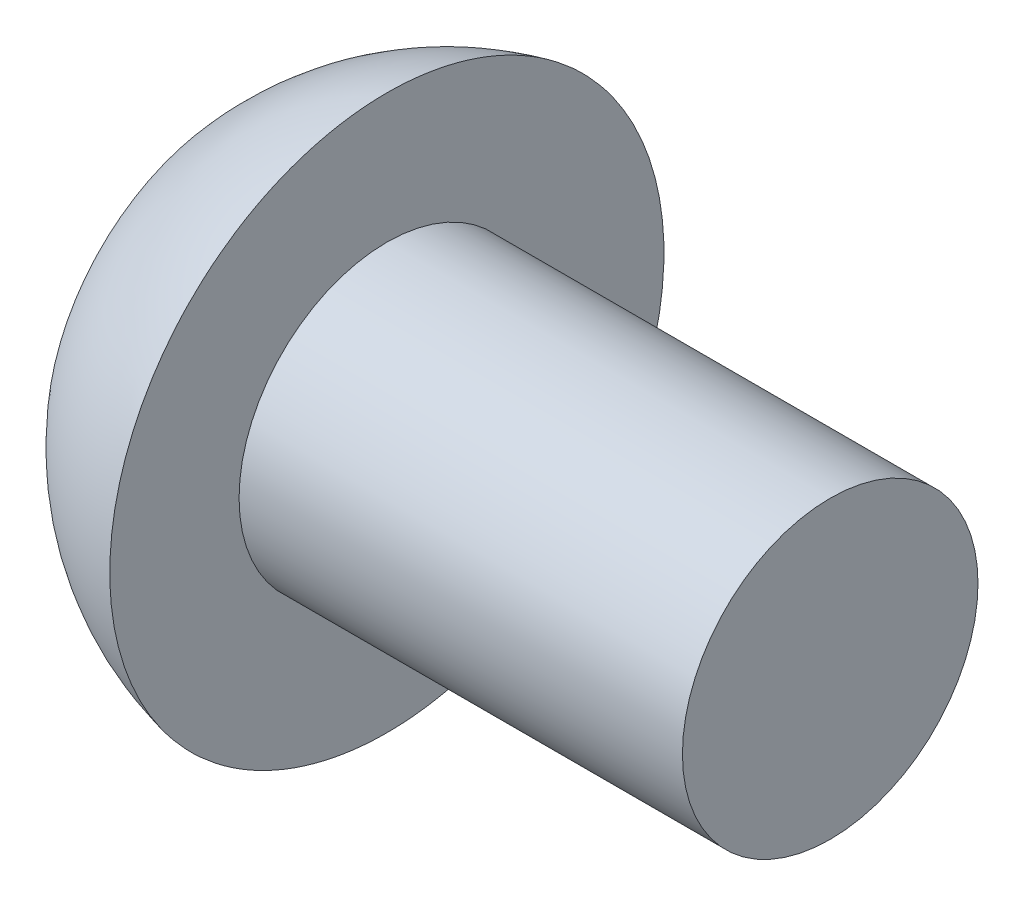
ISO-10303-21;
HEADER;
FILE_DESCRIPTION(('STEP AP214'),'2;1');
FILE_NAME('part.step','',(''),(''),'','','');
FILE_SCHEMA(('AUTOMOTIVE_DESIGN { 1 0 10303 214 1 1 1 1 }'));
ENDSEC;
DATA;
#1=APPLICATION_CONTEXT('core data for automotive mechanical design processes');
#2=APPLICATION_PROTOCOL_DEFINITION('international standard','automotive_design',2000,#1);
#3=PRODUCT_CONTEXT('',#1,'mechanical');
#4=PRODUCT('Part','Part','',(#3));
#5=PRODUCT_RELATED_PRODUCT_CATEGORY('part','',(#4));
#6=PRODUCT_DEFINITION_FORMATION('','',#4);
#7=PRODUCT_DEFINITION_CONTEXT('part definition',#1,'design');
#8=PRODUCT_DEFINITION('design','',#6,#7);
#9=PRODUCT_DEFINITION_SHAPE('','',#8);
#10=(LENGTH_UNIT() NAMED_UNIT(*) SI_UNIT(.MILLI.,.METRE.));
#11=(NAMED_UNIT(*) PLANE_ANGLE_UNIT() SI_UNIT($,.RADIAN.));
#12=(NAMED_UNIT(*) SI_UNIT($,.STERADIAN.) SOLID_ANGLE_UNIT());
#13=UNCERTAINTY_MEASURE_WITH_UNIT(LENGTH_MEASURE(1.E-05),#10,'distance_accuracy_value','');
#14=(GEOMETRIC_REPRESENTATION_CONTEXT(3) GLOBAL_UNCERTAINTY_ASSIGNED_CONTEXT((#13)) GLOBAL_UNIT_ASSIGNED_CONTEXT((#10,
#11,#12)) REPRESENTATION_CONTEXT('',''));
#15=CARTESIAN_POINT('',(0.,0.,0.));
#16=DIRECTION('',(0.,0.,1.));
#17=DIRECTION('',(1.,0.,0.));
#18=AXIS2_PLACEMENT_3D('',#15,#16,#17);
#19=CARTESIAN_POINT('',(1.3,0.,0.));
#20=DIRECTION('',(-1.,0.,0.));
#21=DIRECTION('',(0.,0.,1.));
#22=AXIS2_PLACEMENT_3D('',#19,#20,#21);
#23=PLANE('',#22);
#24=DIRECTION('',(0.,0.866025403784439,-0.5));
#25=VECTOR('',#24,1.);
#26=CARTESIAN_POINT('',(1.3,0.,-1.44337567297406));
#27=LINE('',#26,#25);
#28=CARTESIAN_POINT('',(1.3,0.,-1.44337567297406));
#29=VERTEX_POINT('',#28);
#30=CARTESIAN_POINT('',(1.3,-1.25,-0.721687836487033));
#31=VERTEX_POINT('',#30);
#32=EDGE_CURVE('E95',#29,#31,#27,.F.);
#33=ORIENTED_EDGE('',*,*,#32,.T.);
#34=DIRECTION('',(0.,0.,-1.));
#35=VECTOR('',#34,1.);
#36=CARTESIAN_POINT('',(1.3,-1.25,-0.721687836487033));
#37=LINE('',#36,#35);
#38=CARTESIAN_POINT('',(1.3,-1.25,0.721687836487032));
#39=VERTEX_POINT('',#38);
#40=EDGE_CURVE('E142',#31,#39,#37,.F.);
#41=ORIENTED_EDGE('',*,*,#40,.T.);
#42=DIRECTION('',(0.,-0.866025403784439,-0.5));
#43=VECTOR('',#42,1.);
#44=CARTESIAN_POINT('',(1.3,-1.25,0.721687836487032));
#45=LINE('',#44,#43);
#46=CARTESIAN_POINT('',(1.3,0.,1.44337567297406));
#47=VERTEX_POINT('',#46);
#48=EDGE_CURVE('E137',#39,#47,#45,.F.);
#49=ORIENTED_EDGE('',*,*,#48,.T.);
#50=DIRECTION('',(0.,-0.866025403784439,0.5));
#51=VECTOR('',#50,1.);
#52=CARTESIAN_POINT('',(1.3,0.,1.44337567297406));
#53=LINE('',#52,#51);
#54=CARTESIAN_POINT('',(1.3,1.25,0.721687836487031));
#55=VERTEX_POINT('',#54);
#56=EDGE_CURVE('E78',#47,#55,#53,.F.);
#57=ORIENTED_EDGE('',*,*,#56,.T.);
#58=DIRECTION('',(0.,0.,1.));
#59=VECTOR('',#58,1.);
#60=CARTESIAN_POINT('',(1.3,1.25,0.721687836487031));
#61=LINE('',#60,#59);
#62=CARTESIAN_POINT('',(1.3,1.25,-0.721687836487033));
#63=VERTEX_POINT('',#62);
#64=EDGE_CURVE('E75',#55,#63,#61,.F.);
#65=ORIENTED_EDGE('',*,*,#64,.T.);
#66=DIRECTION('',(0.,0.866025403784439,0.5));
#67=VECTOR('',#66,1.);
#68=CARTESIAN_POINT('',(1.3,1.25,-0.721687836487033));
#69=LINE('',#68,#67);
#70=EDGE_CURVE('E72',#63,#29,#69,.F.);
#71=ORIENTED_EDGE('',*,*,#70,.T.);
#72=EDGE_LOOP('',(#33,#41,#49,#57,#65,#71));
#73=FACE_BOUND('',#72,.T.);
#74=ADVANCED_FACE('F17',(#73),#23,.T.);
#75=CARTESIAN_POINT('',(1.3,1.25,0.721687836487031));
#76=DIRECTION('',(0.,1.,0.));
#77=DIRECTION('',(0.,0.,1.));
#78=AXIS2_PLACEMENT_3D('',#75,#76,#77);
#79=PLANE('',#78);
#80=DIRECTION('',(1.,0.,0.));
#81=VECTOR('',#80,1.);
#82=CARTESIAN_POINT('',(1.3,1.25,-0.721687836487033));
#83=LINE('',#82,#81);
#84=CARTESIAN_POINT('',(0.,1.25,-0.721687836487033));
#85=VERTEX_POINT('',#84);
#86=EDGE_CURVE('E81',#85,#63,#83,.T.);
#87=ORIENTED_EDGE('',*,*,#86,.T.);
#88=ORIENTED_EDGE('',*,*,#64,.F.);
#89=DIRECTION('',(1.,0.,0.));
#90=VECTOR('',#89,1.);
#91=CARTESIAN_POINT('',(1.3,1.25,0.721687836487031));
#92=LINE('',#91,#90);
#93=CARTESIAN_POINT('',(0.,1.25,0.721687836487031));
#94=VERTEX_POINT('',#93);
#95=EDGE_CURVE('E132',#55,#94,#92,.F.);
#96=ORIENTED_EDGE('',*,*,#95,.T.);
#97=DIRECTION('',(0.,0.,-1.));
#98=VECTOR('',#97,1.);
#99=CARTESIAN_POINT('',(0.,1.25,0.));
#100=LINE('',#99,#98);
#101=EDGE_CURVE('E86',#94,#85,#100,.T.);
#102=ORIENTED_EDGE('',*,*,#101,.T.);
#103=EDGE_LOOP('',(#87,#88,#96,#102));
#104=FACE_BOUND('',#103,.T.);
#105=ADVANCED_FACE('F84',(#104),#79,.F.);
#106=CARTESIAN_POINT('',(1.3,1.25,-0.721687836487033));
#107=DIRECTION('',(0.,0.5,-0.866025403784439));
#108=DIRECTION('',(0.,0.866025403784439,0.5));
#109=AXIS2_PLACEMENT_3D('',#106,#107,#108);
#110=PLANE('',#109);
#111=DIRECTION('',(1.,0.,0.));
#112=VECTOR('',#111,1.);
#113=CARTESIAN_POINT('',(1.3,0.,-1.44337567297406));
#114=LINE('',#113,#112);
#115=CARTESIAN_POINT('',(0.,0.,-1.44337567297406));
#116=VERTEX_POINT('',#115);
#117=EDGE_CURVE('E92',#116,#29,#114,.T.);
#118=ORIENTED_EDGE('',*,*,#117,.T.);
#119=ORIENTED_EDGE('',*,*,#70,.F.);
#120=ORIENTED_EDGE('',*,*,#86,.F.);
#121=DIRECTION('',(0.,-0.866025403784439,-0.5));
#122=VECTOR('',#121,1.);
#123=CARTESIAN_POINT('',(0.,1.25,-0.721687836487033));
#124=LINE('',#123,#122);
#125=EDGE_CURVE('E129',#85,#116,#124,.T.);
#126=ORIENTED_EDGE('',*,*,#125,.T.);
#127=EDGE_LOOP('',(#118,#119,#120,#126));
#128=FACE_BOUND('',#127,.T.);
#129=ADVANCED_FACE('F90',(#128),#110,.F.);
#130=CARTESIAN_POINT('',(1.3,0.,-1.44337567297406));
#131=DIRECTION('',(0.,-0.5,-0.866025403784439));
#132=DIRECTION('',(0.,0.866025403784439,-0.5));
#133=AXIS2_PLACEMENT_3D('',#130,#131,#132);
#134=PLANE('',#133);
#135=DIRECTION('',(1.,0.,0.));
#136=VECTOR('',#135,1.);
#137=CARTESIAN_POINT('',(1.3,-1.25,-0.721687836487033));
#138=LINE('',#137,#136);
#139=CARTESIAN_POINT('',(0.,-1.25,-0.721687836487033));
#140=VERTEX_POINT('',#139);
#141=EDGE_CURVE('E144',#140,#31,#138,.T.);
#142=ORIENTED_EDGE('',*,*,#141,.T.);
#143=ORIENTED_EDGE('',*,*,#32,.F.);
#144=ORIENTED_EDGE('',*,*,#117,.F.);
#145=DIRECTION('',(0.,-0.866025403784439,0.5));
#146=VECTOR('',#145,1.);
#147=CARTESIAN_POINT('',(0.,0.,-1.44337567297406));
#148=LINE('',#147,#146);
#149=EDGE_CURVE('E127',#116,#140,#148,.T.);
#150=ORIENTED_EDGE('',*,*,#149,.T.);
#151=EDGE_LOOP('',(#142,#143,#144,#150));
#152=FACE_BOUND('',#151,.T.);
#153=ADVANCED_FACE('F149',(#152),#134,.F.);
#154=CARTESIAN_POINT('',(1.3,-1.25,-0.721687836487033));
#155=DIRECTION('',(0.,-1.,0.));
#156=DIRECTION('',(0.,0.,-1.));
#157=AXIS2_PLACEMENT_3D('',#154,#155,#156);
#158=PLANE('',#157);
#159=DIRECTION('',(1.,0.,0.));
#160=VECTOR('',#159,1.);
#161=CARTESIAN_POINT('',(1.3,-1.25,0.721687836487032));
#162=LINE('',#161,#160);
#163=CARTESIAN_POINT('',(0.,-1.25,0.721687836487032));
#164=VERTEX_POINT('',#163);
#165=EDGE_CURVE('E139',#164,#39,#162,.T.);
#166=ORIENTED_EDGE('',*,*,#165,.T.);
#167=ORIENTED_EDGE('',*,*,#40,.F.);
#168=ORIENTED_EDGE('',*,*,#141,.F.);
#169=DIRECTION('',(0.,0.,-1.));
#170=VECTOR('',#169,1.);
#171=CARTESIAN_POINT('',(0.,-1.25,0.));
#172=LINE('',#171,#170);
#173=EDGE_CURVE('E125',#140,#164,#172,.F.);
#174=ORIENTED_EDGE('',*,*,#173,.T.);
#175=EDGE_LOOP('',(#166,#167,#168,#174));
#176=FACE_BOUND('',#175,.T.);
#177=ADVANCED_FACE('F153',(#176),#158,.F.);
#178=CARTESIAN_POINT('',(1.3,-1.25,0.721687836487032));
#179=DIRECTION('',(0.,-0.5,0.866025403784439));
#180=DIRECTION('',(0.,-0.866025403784439,-0.5));
#181=AXIS2_PLACEMENT_3D('',#178,#179,#180);
#182=PLANE('',#181);
#183=DIRECTION('',(1.,0.,0.));
#184=VECTOR('',#183,1.);
#185=CARTESIAN_POINT('',(1.3,0.,1.44337567297406));
#186=LINE('',#185,#184);
#187=CARTESIAN_POINT('',(0.,0.,1.44337567297406));
#188=VERTEX_POINT('',#187);
#189=EDGE_CURVE('E135',#188,#47,#186,.T.);
#190=ORIENTED_EDGE('',*,*,#189,.T.);
#191=ORIENTED_EDGE('',*,*,#48,.F.);
#192=ORIENTED_EDGE('',*,*,#165,.F.);
#193=DIRECTION('',(0.,0.866025403784439,0.5));
#194=VECTOR('',#193,1.);
#195=CARTESIAN_POINT('',(0.,-1.25,0.721687836487032));
#196=LINE('',#195,#194);
#197=EDGE_CURVE('E39',#164,#188,#196,.T.);
#198=ORIENTED_EDGE('',*,*,#197,.T.);
#199=EDGE_LOOP('',(#190,#191,#192,#198));
#200=FACE_BOUND('',#199,.T.);
#201=ADVANCED_FACE('F155',(#200),#182,.F.);
#202=CARTESIAN_POINT('',(1.3,0.,1.44337567297406));
#203=DIRECTION('',(0.,0.5,0.866025403784439));
#204=DIRECTION('',(0.,-0.866025403784439,0.5));
#205=AXIS2_PLACEMENT_3D('',#202,#203,#204);
#206=PLANE('',#205);
#207=ORIENTED_EDGE('',*,*,#95,.F.);
#208=ORIENTED_EDGE('',*,*,#56,.F.);
#209=ORIENTED_EDGE('',*,*,#189,.F.);
#210=DIRECTION('',(0.,0.866025403784439,-0.5));
#211=VECTOR('',#210,1.);
#212=CARTESIAN_POINT('',(0.,0.,1.44337567297406));
#213=LINE('',#212,#211);
#214=EDGE_CURVE('E121',#188,#94,#213,.T.);
#215=ORIENTED_EDGE('',*,*,#214,.T.);
#216=EDGE_LOOP('',(#207,#208,#209,#215));
#217=FACE_BOUND('',#216,.T.);
#218=ADVANCED_FACE('F158',(#217),#206,.F.);
#219=CARTESIAN_POINT('',(0.,0.,0.));
#220=DIRECTION('',(1.,0.,0.));
#221=DIRECTION('',(0.,0.,-1.));
#222=AXIS2_PLACEMENT_3D('',#219,#220,#221);
#223=PLANE('',#222);
#224=CARTESIAN_POINT('',(0.,-2.5,0.));
#225=CARTESIAN_POINT('',(0.,-2.49999957936132,-0.0701921599960447));
#226=CARTESIAN_POINT('',(0.,-2.49704119342716,-0.140397219697565));
#227=CARTESIAN_POINT('',(0.,-2.48522688336905,-0.280322179188911));
#228=CARTESIAN_POINT('',(0.,-2.47636921810709,-0.350041929602119));
#229=CARTESIAN_POINT('',(0.,-2.45279620034309,-0.488604766514831));
#230=CARTESIAN_POINT('',(0.,-2.43807154943064,-0.557446281525975));
#231=CARTESIAN_POINT('',(0.,-2.40286605989034,-0.693682439581397));
#232=CARTESIAN_POINT('',(0.,-2.38238055007889,-0.761075860507865));
#233=CARTESIAN_POINT('',(0.,-2.31256595562957,-0.960073508547833));
#234=CARTESIAN_POINT('',(0.,-2.25482146137571,-1.08883001715421));
#235=CARTESIAN_POINT('',(0.,-2.11850508057902,-1.33480670428014));
#236=CARTESIAN_POINT('',(0.,-2.03993240229859,-1.45202644402247));
#237=CARTESIAN_POINT('',(0.,-1.90824104297611,-1.61665670241218));
#238=CARTESIAN_POINT('',(0.,-1.8620037639557,-1.66969790909812));
#239=CARTESIAN_POINT('',(0.,-1.76526174331412,-1.77166010119879));
#240=CARTESIAN_POINT('',(0.,-1.71476115915119,-1.82058500982101));
#241=CARTESIAN_POINT('',(0.,-1.60979378920237,-1.91402800842039));
#242=CARTESIAN_POINT('',(0.,-1.55532521712319,-1.95854409210621));
#243=CARTESIAN_POINT('',(0.,-1.44283652737546,-2.04283394018785));
#244=CARTESIAN_POINT('',(0.,-1.38481559005068,-2.08260660382087));
#245=CARTESIAN_POINT('',(0.,-1.20605688653428,-2.19433902055891));
#246=CARTESIAN_POINT('',(0.,-1.08051229851521,-2.25881176834579));
#247=CARTESIAN_POINT('',(0.,-0.820448664949676,-2.36572576688644));
#248=CARTESIAN_POINT('',(1.93521310923399E-13,-0.685929715270905,-2.40816725294437));
#249=CARTESIAN_POINT('',(1.8117892693104E-13,-0.411658452824049,-2.46987540914283));
#250=CARTESIAN_POINT('',(0.,-0.271906112111544,-2.48914195551932));
#251=CARTESIAN_POINT('',(0.,0.00884938351142635,-2.50393336511607));
#252=CARTESIAN_POINT('',(0.,0.149852538421891,-2.49945822833632));
#253=CARTESIAN_POINT('',(0.,0.429089566312493,-2.46691127455503));
#254=CARTESIAN_POINT('',(0.,0.567323454077604,-2.43883958356868));
#255=CARTESIAN_POINT('',(0.,0.837181597907466,-2.35984414828296));
#256=CARTESIAN_POINT('',(0.,0.968805783360285,-2.30892015990856));
#257=CARTESIAN_POINT('',(0.,1.15831539846374,-2.21658970547271));
#258=CARTESIAN_POINT('',(0.,1.22019432802738,-2.1831338836091));
#259=CARTESIAN_POINT('',(0.,1.34091721220196,-2.11113062640944));
#260=CARTESIAN_POINT('',(0.,1.39976186626677,-2.07258437186948));
#261=CARTESIAN_POINT('',(0.,1.51396685324675,-1.99068831769029));
#262=CARTESIAN_POINT('',(0.,1.56932875175144,-1.94734070093405));
#263=CARTESIAN_POINT('',(0.,1.67624909519159,-1.85610831998061));
#264=CARTESIAN_POINT('',(0.,1.72780381792284,-1.80821921744136));
#265=CARTESIAN_POINT('',(1.28795875149044E-13,1.8760649939344,-1.65833806523957));
#266=CARTESIAN_POINT('',(0.,1.96651979560597,-1.55002342166828));
#267=CARTESIAN_POINT('',(0.,2.12792802522677,-1.31973215024525));
#268=CARTESIAN_POINT('',(0.,2.19888219442522,-1.19775604193507));
#269=CARTESIAN_POINT('',(0.,2.28922037059513,-1.00719593212754));
#270=CARTESIAN_POINT('',(0.,2.31667397063703,-0.942328150131031));
#271=CARTESIAN_POINT('',(0.,2.3659998478264,-0.810545468814501));
#272=CARTESIAN_POINT('',(0.,2.3878766418818,-0.743632275680556));
#273=CARTESIAN_POINT('',(0.,2.4258789239337,-0.608313490958524));
#274=CARTESIAN_POINT('',(0.,2.44201349373827,-0.539910439207929));
#275=CARTESIAN_POINT('',(0.,2.46846529090744,-0.402001503176486));
#276=CARTESIAN_POINT('',(0.,2.47878423407526,-0.332495950398821));
#277=CARTESIAN_POINT('',(0.,2.49076983986676,-0.21906889148678));
#278=CARTESIAN_POINT('',(0.,2.49423005456515,-0.175328990096958));
#279=CARTESIAN_POINT('',(0.,2.49884526607024,-0.0877277385030351));
#280=CARTESIAN_POINT('',(0.,2.50000026287693,-0.0438663882989335));
#281=CARTESIAN_POINT('',(0.,2.49999957936132,0.070192159996044));
#282=CARTESIAN_POINT('',(0.,2.49704119342716,0.140397219697564));
#283=CARTESIAN_POINT('',(0.,2.48522688336906,0.280322179188911));
#284=CARTESIAN_POINT('',(0.,2.47636921810709,0.350041929602119));
#285=CARTESIAN_POINT('',(0.,2.45279620034309,0.488604766514831));
#286=CARTESIAN_POINT('',(0.,2.43807154943064,0.557446281525974));
#287=CARTESIAN_POINT('',(0.,2.40286605989033,0.693682439581397));
#288=CARTESIAN_POINT('',(0.,2.38238055007889,0.761075860507866));
#289=CARTESIAN_POINT('',(0.,2.31256595562957,0.960073508547833));
#290=CARTESIAN_POINT('',(0.,2.25482146137571,1.08883001715421));
#291=CARTESIAN_POINT('',(0.,2.11850508057902,1.33480670428014));
#292=CARTESIAN_POINT('',(0.,2.03993240229859,1.45202644402247));
#293=CARTESIAN_POINT('',(0.,1.90824104297611,1.61665670241218));
#294=CARTESIAN_POINT('',(0.,1.8620037639557,1.66969790909812));
#295=CARTESIAN_POINT('',(0.,1.76526174331412,1.77166010119879));
#296=CARTESIAN_POINT('',(0.,1.71476115915119,1.82058500982101));
#297=CARTESIAN_POINT('',(0.,1.60979378920237,1.91402800842039));
#298=CARTESIAN_POINT('',(0.,1.55532521712319,1.95854409210621));
#299=CARTESIAN_POINT('',(0.,1.44283652737546,2.04283394018785));
#300=CARTESIAN_POINT('',(0.,1.38481559005068,2.08260660382087));
#301=CARTESIAN_POINT('',(0.,1.20605688653428,2.19433902055891));
#302=CARTESIAN_POINT('',(0.,1.08051229851521,2.25881176834579));
#303=CARTESIAN_POINT('',(0.,0.820448664949675,2.36572576688643));
#304=CARTESIAN_POINT('',(1.93183748400447E-13,0.685929715270904,2.40816725294437));
#305=CARTESIAN_POINT('',(1.81516491256711E-13,0.411658452824049,2.46987540914282));
#306=CARTESIAN_POINT('',(0.,0.271906112111543,2.48914195551932));
#307=CARTESIAN_POINT('',(0.,-0.0088493835114267,2.50393336511607));
#308=CARTESIAN_POINT('',(0.,-0.149852538421892,2.49945822833632));
#309=CARTESIAN_POINT('',(0.,-0.429089566312493,2.46691127455503));
#310=CARTESIAN_POINT('',(0.,-0.567323454077604,2.43883958356868));
#311=CARTESIAN_POINT('',(0.,-0.837181597907466,2.35984414828296));
#312=CARTESIAN_POINT('',(0.,-0.968805783360285,2.30892015990856));
#313=CARTESIAN_POINT('',(0.,-1.15831539846374,2.21658970547271));
#314=CARTESIAN_POINT('',(0.,-1.22019432802738,2.1831338836091));
#315=CARTESIAN_POINT('',(0.,-1.34091721220196,2.11113062640944));
#316=CARTESIAN_POINT('',(0.,-1.39976186626677,2.07258437186948));
#317=CARTESIAN_POINT('',(0.,-1.51396685324675,1.99068831769029));
#318=CARTESIAN_POINT('',(0.,-1.56932875175144,1.94734070093405));
#319=CARTESIAN_POINT('',(0.,-1.67624909519159,1.85610831998061));
#320=CARTESIAN_POINT('',(0.,-1.72780381792284,1.80821921744136));
#321=CARTESIAN_POINT('',(1.26351396747164E-13,-1.8760649939344,1.65833806523957));
#322=CARTESIAN_POINT('',(0.,-1.96651979560597,1.55002342166828));
#323=CARTESIAN_POINT('',(0.,-2.12792802522677,1.31973215024525));
#324=CARTESIAN_POINT('',(0.,-2.19888219442522,1.19775604193507));
#325=CARTESIAN_POINT('',(0.,-2.28922037059513,1.00719593212754));
#326=CARTESIAN_POINT('',(0.,-2.31667397063703,0.942328150131031));
#327=CARTESIAN_POINT('',(0.,-2.3659998478264,0.810545468814502));
#328=CARTESIAN_POINT('',(0.,-2.3878766418818,0.743632275680556));
#329=CARTESIAN_POINT('',(0.,-2.4258789239337,0.608313490958524));
#330=CARTESIAN_POINT('',(0.,-2.44201349373827,0.539910439207929));
#331=CARTESIAN_POINT('',(0.,-2.46846529090744,0.402001503176486));
#332=CARTESIAN_POINT('',(0.,-2.47878423407526,0.33249595039882));
#333=CARTESIAN_POINT('',(0.,-2.49076983986676,0.219068891486779));
#334=CARTESIAN_POINT('',(0.,-2.49423005456516,0.175328990096958));
#335=CARTESIAN_POINT('',(0.,-2.49884526607024,0.0877277385030345));
#336=CARTESIAN_POINT('',(0.,-2.50000026287693,0.0438663882989328));
#337=CARTESIAN_POINT('',(0.,-2.5,0.));
#338=B_SPLINE_CURVE_WITH_KNOTS('',3,(#224,#225,#226,#227,#228,#229,#230,#231,#232,#233,#234,
#235,#236,#237,#238,#239,#240,#241,#242,#243,#244,#245,#246,#247,#248,#249,#250,#251,#252,#253,
#254,#255,#256,#257,#258,#259,#260,#261,#262,#263,#264,#265,#266,#267,#268,#269,#270,#271,#272,
#273,#274,#275,#276,#277,#278,#279,#280,#281,#282,#283,#284,#285,#286,#287,#288,#289,#290,#291,
#292,#293,#294,#295,#296,#297,#298,#299,#300,#301,#302,#303,#304,#305,#306,#307,#308,#309,#310,
#311,#312,#313,#314,#315,#316,#317,#318,#319,#320,#321,#322,#323,#324,#325,#326,#327,#328,#329,
#330,#331,#332,#333,#334,#335,#336,#337),.UNSPECIFIED.,.T.,.F.,(4,2,2,2,2,2,2,2,2,2,2,2,2,2,2,2,
2,2,2,2,2,2,2,2,2,2,2,2,2,2,2,2,2,2,2,2,2,2,2,2,2,2,2,2,2,2,2,2,2,2,2,2,2,2,2,2,4),(0.,
0.210536096820072,0.421134359699302,0.632067729618591,0.843172630152281,1.2643761190993,
1.68559562146689,1.89648135010456,2.10716375313716,2.31794159353161,2.52876825245848,
2.94998199754238,3.37119124377402,3.7924027394319,4.2136142350898,4.63482348132149,
5.05603722640544,5.26686388533231,5.47764172572676,5.68832412875937,5.89920985739704,
6.32042935976463,6.74163284871166,6.95273774924535,7.16367111916464,7.37426938204387,
7.58480547886394,7.71637940641613,7.84795333396831,8.05848943078838,8.26908769366761,
8.4800210635869,8.69112596412059,9.11232945306761,9.53354895543521,9.74443468407287,
9.95511708710547,10.1658949274999,10.3767215864268,10.7979353315107,11.2191445777423,
11.6403560734002,12.0615675690581,12.4827768152898,12.9039905603737,13.1148172193006,
13.3255950596951,13.5362774627277,13.7471631913654,14.1683826937329,14.58958618268,
14.8006910832137,15.0116244531329,15.2222227160122,15.4327588128323,15.5643327403844,
15.6959066679366),.UNSPECIFIED.);
#339=CARTESIAN_POINT('',(0.,-2.5,0.));
#340=VERTEX_POINT('',#339);
#341=EDGE_CURVE('E20',#340,#340,#338,.T.);
#342=ORIENTED_EDGE('',*,*,#341,.F.);
#343=EDGE_LOOP('',(#342));
#344=FACE_BOUND('',#343,.T.);
#345=ORIENTED_EDGE('',*,*,#197,.F.);
#346=ORIENTED_EDGE('',*,*,#173,.F.);
#347=ORIENTED_EDGE('',*,*,#149,.F.);
#348=ORIENTED_EDGE('',*,*,#125,.F.);
#349=ORIENTED_EDGE('',*,*,#101,.F.);
#350=ORIENTED_EDGE('',*,*,#214,.F.);
#351=EDGE_LOOP('',(#345,#346,#347,#348,#349,#350));
#352=FACE_BOUND('',#351,.T.);
#353=ADVANCED_FACE('F114',(#344,#352),#223,.F.);
#354=CARTESIAN_POINT('',(2.91011904761905,0.,0.));
#355=DIRECTION('',(0.,1.,0.));
#356=DIRECTION('',(1.,0.,0.));
#357=AXIS2_PLACEMENT_3D('',#354,#355,#356);
#358=SPHERICAL_SURFACE('',#357,3.83650790059335);
#359=ORIENTED_EDGE('',*,*,#341,.T.);
#360=EDGE_LOOP('',(#359));
#361=FACE_BOUND('',#360,.T.);
#362=CARTESIAN_POINT('',(2.1,3.75,0.));
#363=CARTESIAN_POINT('',(2.1,3.74999970807574,-0.128760923490167));
#364=CARTESIAN_POINT('',(2.1,3.74335977074872,-0.257513251563214));
#365=CARTESIAN_POINT('',(2.1,3.716882281265,-0.51371210902152));
#366=CARTESIAN_POINT('',(2.1,3.69703612887407,-0.641157732492684));
#367=CARTESIAN_POINT('',(2.1,3.62754876330157,-0.973487008399234));
#368=CARTESIAN_POINT('',(2.1,3.56699233056529,-1.17619451338168));
#369=CARTESIAN_POINT('',(2.1,3.4126598106451,-1.56870187284758));
#370=CARTESIAN_POINT('',(2.1,3.31884766941476,-1.75848745081441));
#371=CARTESIAN_POINT('',(2.1,3.10071840543423,-2.11954960907214));
#372=CARTESIAN_POINT('',(2.1,2.9764142984283,-2.29083404191258));
#373=CARTESIAN_POINT('',(2.1,2.70084505467837,-2.61005630953823));
#374=CARTESIAN_POINT('',(2.1,2.54958623794051,-2.75799960176747));
#375=CARTESIAN_POINT('',(2.1,2.22436407466361,-3.02641034330814));
#376=CARTESIAN_POINT('',(2.1,2.05039852450514,-3.14687512279185));
#377=CARTESIAN_POINT('',(2.1,1.68470537542659,-3.35689292819582));
#378=CARTESIAN_POINT('',(2.1,1.49297706679099,-3.44644471830357));
#379=CARTESIAN_POINT('',(2.1,1.09721074586232,-3.5920868824784));
#380=CARTESIAN_POINT('',(2.1,0.893172961208296,-3.64817787512701));
#381=CARTESIAN_POINT('',(2.1,0.478577157929979,-3.725308519612));
#382=CARTESIAN_POINT('',(2.1,0.268019158844183,-3.74634827647265));
#383=CARTESIAN_POINT('',(2.1,-0.153640712009164,-3.75277951087031));
#384=CARTESIAN_POINT('',(2.1,-0.364742584143868,-3.73817096433584));
#385=CARTESIAN_POINT('',(2.1,-0.781497786795863,-3.67372036075235));
#386=CARTESIAN_POINT('',(2.1,-0.987151108345241,-3.62387824571522));
#387=CARTESIAN_POINT('',(2.1,-1.38717375779039,-3.49037374799647));
#388=CARTESIAN_POINT('',(2.1,-1.58154294054961,-3.40671093042329));
#389=CARTESIAN_POINT('',(2.1,-1.95347077346291,-3.20794537549092));
#390=CARTESIAN_POINT('',(2.1,-2.13102988347079,-3.09284349850873));
#391=CARTESIAN_POINT('',(2.1,-2.46429538879519,-2.834464966857));
#392=CARTESIAN_POINT('',(2.1,-2.62000323603539,-2.69119018567784));
#393=CARTESIAN_POINT('',(2.1,-2.90517199434076,-2.38053917273111));
#394=CARTESIAN_POINT('',(2.10000000000001,-3.03462869324269,-2.21315908047067));
#395=CARTESIAN_POINT('',(2.10000000000001,-3.26366553138365,-1.8588784717437));
#396=CARTESIAN_POINT('',(2.1,-3.36323701442936,-1.67197232068498));
#397=CARTESIAN_POINT('',(2.1,-3.48790054566113,-1.38137663397895));
#398=CARTESIAN_POINT('',(2.1,-3.52533839030707,-1.28280966784368));
#399=CARTESIAN_POINT('',(2.1,-3.59181195816412,-1.08281306376821));
#400=CARTESIAN_POINT('',(2.1,-3.62084375060508,-0.981382110845903));
#401=CARTESIAN_POINT('',(2.1,-3.68020647852303,-0.735144085500722));
#402=CARTESIAN_POINT('',(2.1,-3.70635667301652,-0.589311118238873));
#403=CARTESIAN_POINT('',(2.1,-3.74125017354579,-0.295647784790676));
#404=CARTESIAN_POINT('',(2.1,-3.7500003351306,-0.147818228375296));
#405=CARTESIAN_POINT('',(2.1,-3.74999970807574,0.128760923490166));
#406=CARTESIAN_POINT('',(2.1,-3.74335977074872,0.257513251563213));
#407=CARTESIAN_POINT('',(2.1,-3.716882281265,0.513712109021519));
#408=CARTESIAN_POINT('',(2.1,-3.69703612887407,0.641157732492683));
#409=CARTESIAN_POINT('',(2.1,-3.62754876330157,0.973487008399232));
#410=CARTESIAN_POINT('',(2.1,-3.5669923305653,1.17619451338167));
#411=CARTESIAN_POINT('',(2.1,-3.4126598106451,1.56870187284758));
#412=CARTESIAN_POINT('',(2.1,-3.31884766941476,1.75848745081441));
#413=CARTESIAN_POINT('',(2.1,-3.10071840543423,2.11954960907213));
#414=CARTESIAN_POINT('',(2.1,-2.9764142984283,2.29083404191258));
#415=CARTESIAN_POINT('',(2.1,-2.70084505467837,2.61005630953823));
#416=CARTESIAN_POINT('',(2.1,-2.54958623794051,2.75799960176747));
#417=CARTESIAN_POINT('',(2.1,-2.22436407466361,3.02641034330814));
#418=CARTESIAN_POINT('',(2.1,-2.05039852450514,3.14687512279185));
#419=CARTESIAN_POINT('',(2.1,-1.68470537542659,3.35689292819582));
#420=CARTESIAN_POINT('',(2.1,-1.49297706679099,3.44644471830357));
#421=CARTESIAN_POINT('',(2.1,-1.09721074586232,3.5920868824784));
#422=CARTESIAN_POINT('',(2.1,-0.893172961208295,3.64817787512701));
#423=CARTESIAN_POINT('',(2.1,-0.478577157929977,3.725308519612));
#424=CARTESIAN_POINT('',(2.1,-0.268019158844181,3.74634827647265));
#425=CARTESIAN_POINT('',(2.1,0.153640712009165,3.75277951087031));
#426=CARTESIAN_POINT('',(2.1,0.36474258414387,3.73817096433584));
#427=CARTESIAN_POINT('',(2.1,0.781497786795864,3.67372036075235));
#428=CARTESIAN_POINT('',(2.1,0.987151108345243,3.62387824571522));
#429=CARTESIAN_POINT('',(2.1,1.38717375779039,3.49037374799647));
#430=CARTESIAN_POINT('',(2.1,1.58154294054962,3.40671093042329));
#431=CARTESIAN_POINT('',(2.1,1.95347077346291,3.20794537549092));
#432=CARTESIAN_POINT('',(2.1,2.13102988347079,3.09284349850872));
#433=CARTESIAN_POINT('',(2.1,2.46429538879519,2.834464966857));
#434=CARTESIAN_POINT('',(2.1,2.62000323603539,2.69119018567783));
#435=CARTESIAN_POINT('',(2.1,2.90517199434076,2.3805391727311));
#436=CARTESIAN_POINT('',(2.10000000000001,3.0346286932427,2.21315908047067));
#437=CARTESIAN_POINT('',(2.10000000000001,3.26366553138365,1.8588784717437));
#438=CARTESIAN_POINT('',(2.1,3.36323701442936,1.67197232068498));
#439=CARTESIAN_POINT('',(2.1,3.48790054566113,1.38137663397895));
#440=CARTESIAN_POINT('',(2.1,3.52533839030707,1.28280966784367));
#441=CARTESIAN_POINT('',(2.1,3.59181195816412,1.0828130637682));
#442=CARTESIAN_POINT('',(2.1,3.62084375060508,0.9813821108459));
#443=CARTESIAN_POINT('',(2.1,3.68020647852303,0.735144085500719));
#444=CARTESIAN_POINT('',(2.1,3.70635667301652,0.58931111823887));
#445=CARTESIAN_POINT('',(2.1,3.74125017354579,0.295647784790675));
#446=CARTESIAN_POINT('',(2.1,3.7500003351306,0.147818228375295));
#447=CARTESIAN_POINT('',(2.1,3.75,0.));
#448=B_SPLINE_CURVE_WITH_KNOTS('',3,(#362,#363,#364,#365,#366,#367,#368,#369,#370,#371,#372,
#373,#374,#375,#376,#377,#378,#379,#380,#381,#382,#383,#384,#385,#386,#387,#388,#389,#390,#391,
#392,#393,#394,#395,#396,#397,#398,#399,#400,#401,#402,#403,#404,#405,#406,#407,#408,#409,#410,
#411,#412,#413,#414,#415,#416,#417,#418,#419,#420,#421,#422,#423,#424,#425,#426,#427,#428,#429,
#430,#431,#432,#433,#434,#435,#436,#437,#438,#439,#440,#441,#442,#443,#444,#445,#446,#447),
.UNSPECIFIED.,.T.,.F.,(4,2,2,2,2,2,2,2,2,2,2,2,2,2,2,2,2,2,2,2,2,2,2,2,2,2,2,2,2,2,2,2,2,2,2,2,
2,2,2,2,2,2,4),(0.,0.386082832525484,0.772417338718153,1.40389122442898,2.03605182443357,
2.66794304966592,3.2996863113492,3.93149092744213,4.56332079834451,5.19513898840152,
5.82695528533354,6.45877200889888,7.09058977232332,7.72241566038554,8.35422425931722,
8.98599085735152,9.61785874626913,10.249909478232,10.5659083946051,10.8820548380766,
11.3254547259403,11.7686798812367,12.1547627137622,12.5410972199548,13.1725711056657,
13.8047317056702,14.4366229309026,15.0683661925859,15.7001708086788,16.3320006795812,
16.9638188696382,17.5956351665702,18.2274518901356,18.85926965356,19.4910955416222,
20.1229041405539,20.7546707385882,21.3865386275058,22.0185893594686,22.3345882758417,
22.6507347193133,23.094134607177,23.5373597624734),.UNSPECIFIED.);
#449=CARTESIAN_POINT('',(2.1,3.75,0.));
#450=VERTEX_POINT('',#449);
#451=EDGE_CURVE('E100',#450,#450,#448,.T.);
#452=ORIENTED_EDGE('',*,*,#451,.T.);
#453=EDGE_LOOP('',(#452));
#454=FACE_BOUND('',#453,.T.);
#455=ADVANCED_FACE('F109',(#361,#454),#358,.T.);
#456=CARTESIAN_POINT('',(8.1,0.,0.));
#457=DIRECTION('',(-1.,0.,0.));
#458=DIRECTION('',(0.,0.,1.));
#459=AXIS2_PLACEMENT_3D('',#456,#457,#458);
#460=PLANE('',#459);
#461=CARTESIAN_POINT('',(8.1,0.,0.));
#462=DIRECTION('',(-1.,0.,0.));
#463=DIRECTION('',(0.,0.,1.));
#464=AXIS2_PLACEMENT_3D('',#461,#462,#463);
#465=CIRCLE('',#464,2.);
#466=CARTESIAN_POINT('',(8.1,0.,2.));
#467=VERTEX_POINT('',#466);
#468=EDGE_CURVE('E30',#467,#467,#465,.T.);
#469=ORIENTED_EDGE('',*,*,#468,.F.);
#470=EDGE_LOOP('',(#469));
#471=FACE_BOUND('',#470,.T.);
#472=ADVANCED_FACE('F113',(#471),#460,.F.);
#473=CARTESIAN_POINT('',(2.1,2.,0.));
#474=DIRECTION('',(-1.,0.,0.));
#475=DIRECTION('',(0.,0.,1.));
#476=AXIS2_PLACEMENT_3D('',#473,#474,#475);
#477=PLANE('',#476);
#478=CARTESIAN_POINT('',(2.1,0.,0.));
#479=DIRECTION('',(-1.,0.,0.));
#480=DIRECTION('',(0.,0.,1.));
#481=AXIS2_PLACEMENT_3D('',#478,#479,#480);
#482=CIRCLE('',#481,2.);
#483=CARTESIAN_POINT('',(2.1,0.,2.));
#484=VERTEX_POINT('',#483);
#485=EDGE_CURVE('E11',#484,#484,#482,.F.);
#486=ORIENTED_EDGE('',*,*,#485,.F.);
#487=EDGE_LOOP('',(#486));
#488=FACE_BOUND('',#487,.T.);
#489=ORIENTED_EDGE('',*,*,#451,.F.);
#490=EDGE_LOOP('',(#489));
#491=FACE_BOUND('',#490,.T.);
#492=ADVANCED_FACE('F105',(#488,#491),#477,.F.);
#493=CARTESIAN_POINT('',(-16.5029441624365,0.,0.));
#494=DIRECTION('',(-1.,0.,0.));
#495=DIRECTION('',(0.,0.,1.));
#496=AXIS2_PLACEMENT_3D('',#493,#494,#495);
#497=CYLINDRICAL_SURFACE('',#496,2.);
#498=ORIENTED_EDGE('',*,*,#485,.T.);
#499=EDGE_LOOP('',(#498));
#500=FACE_BOUND('',#499,.T.);
#501=ORIENTED_EDGE('',*,*,#468,.T.);
#502=EDGE_LOOP('',(#501));
#503=FACE_BOUND('',#502,.T.);
#504=ADVANCED_FACE('F167',(#500,#503),#497,.T.);
#505=CLOSED_SHELL('',(#74,#105,#129,#153,#177,#201,#218,#353,#455,#472,#492,#504));
#506=MANIFOLD_SOLID_BREP('B1',#505);
#507=ADVANCED_BREP_SHAPE_REPRESENTATION('',(#18,#506),#14);
#508=SHAPE_DEFINITION_REPRESENTATION(#9,#507);
ENDSEC;
END-ISO-10303-21;
